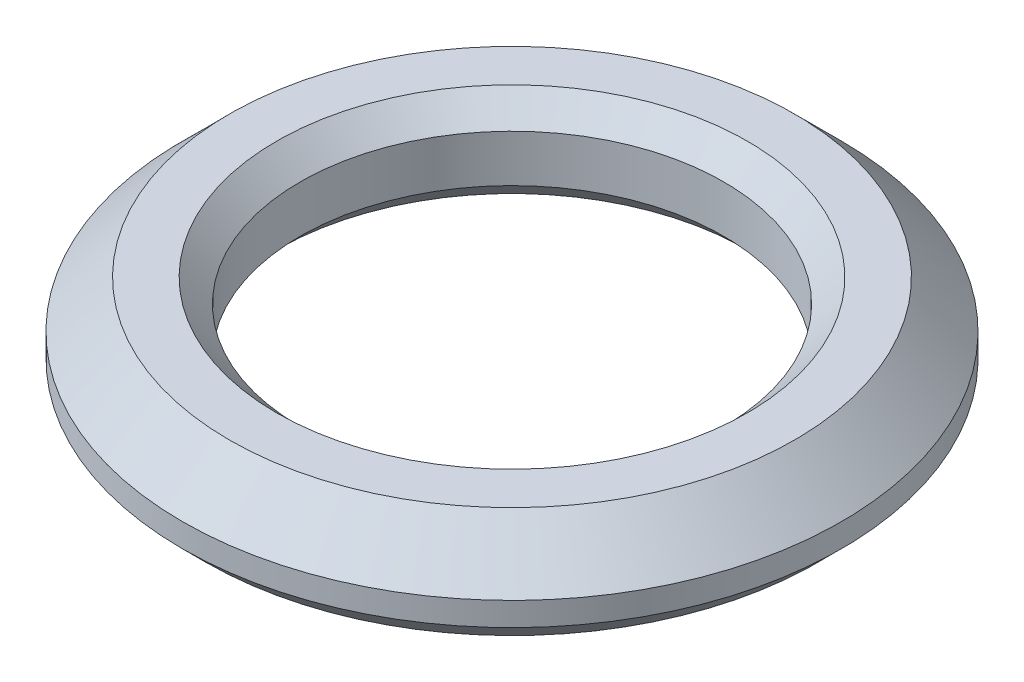
ISO-10303-21;
HEADER;
FILE_DESCRIPTION(('STEP AP214'),'2;1');
FILE_NAME('part.step','',(''),(''),'','','');
FILE_SCHEMA(('AUTOMOTIVE_DESIGN { 1 0 10303 214 1 1 1 1 }'));
ENDSEC;
DATA;
#1=APPLICATION_CONTEXT('core data for automotive mechanical design processes');
#2=APPLICATION_PROTOCOL_DEFINITION('international standard','automotive_design',2000,#1);
#3=PRODUCT_CONTEXT('',#1,'mechanical');
#4=PRODUCT('Part','Part','',(#3));
#5=PRODUCT_RELATED_PRODUCT_CATEGORY('part','',(#4));
#6=PRODUCT_DEFINITION_FORMATION('','',#4);
#7=PRODUCT_DEFINITION_CONTEXT('part definition',#1,'design');
#8=PRODUCT_DEFINITION('design','',#6,#7);
#9=PRODUCT_DEFINITION_SHAPE('','',#8);
#10=(LENGTH_UNIT() NAMED_UNIT(*) SI_UNIT(.MILLI.,.METRE.));
#11=(NAMED_UNIT(*) PLANE_ANGLE_UNIT() SI_UNIT($,.RADIAN.));
#12=(NAMED_UNIT(*) SI_UNIT($,.STERADIAN.) SOLID_ANGLE_UNIT());
#13=UNCERTAINTY_MEASURE_WITH_UNIT(LENGTH_MEASURE(1.E-05),#10,'distance_accuracy_value','');
#14=(GEOMETRIC_REPRESENTATION_CONTEXT(3) GLOBAL_UNCERTAINTY_ASSIGNED_CONTEXT((#13)) GLOBAL_UNIT_ASSIGNED_CONTEXT((#10,
#11,#12)) REPRESENTATION_CONTEXT('',''));
#15=CARTESIAN_POINT('',(0.,0.,0.));
#16=DIRECTION('',(0.,0.,1.));
#17=DIRECTION('',(1.,0.,0.));
#18=AXIS2_PLACEMENT_3D('',#15,#16,#17);
#19=CARTESIAN_POINT('',(0.,2.,0.));
#20=DIRECTION('',(0.,1.,0.));
#21=DIRECTION('',(0.,0.,1.));
#22=AXIS2_PLACEMENT_3D('',#19,#20,#21);
#23=PLANE('',#22);
#24=CARTESIAN_POINT('',(0.,2.,0.));
#25=DIRECTION('',(0.,1.,0.));
#26=DIRECTION('',(0.,0.,1.));
#27=AXIS2_PLACEMENT_3D('',#24,#25,#26);
#28=CIRCLE('',#27,5.);
#29=CARTESIAN_POINT('',(0.,2.,5.));
#30=VERTEX_POINT('',#29);
#31=EDGE_CURVE('E46',#30,#30,#28,.F.);
#32=ORIENTED_EDGE('',*,*,#31,.T.);
#33=EDGE_LOOP('',(#32));
#34=FACE_BOUND('',#33,.T.);
#35=CARTESIAN_POINT('',(0.,2.,0.));
#36=DIRECTION('',(0.,1.,0.));
#37=DIRECTION('',(0.,0.,1.));
#38=AXIS2_PLACEMENT_3D('',#35,#36,#37);
#39=CIRCLE('',#38,6.);
#40=CARTESIAN_POINT('',(0.,2.,6.));
#41=VERTEX_POINT('',#40);
#42=EDGE_CURVE('E60',#41,#41,#39,.T.);
#43=ORIENTED_EDGE('',*,*,#42,.T.);
#44=EDGE_LOOP('',(#43));
#45=FACE_BOUND('',#44,.T.);
#46=ADVANCED_FACE('F31',(#34,#45),#23,.T.);
#47=CARTESIAN_POINT('',(0.,0.,0.));
#48=DIRECTION('',(0.,1.,0.));
#49=DIRECTION('',(0.,0.,1.));
#50=AXIS2_PLACEMENT_3D('',#47,#48,#49);
#51=PLANE('',#50);
#52=CARTESIAN_POINT('',(0.,0.,0.));
#53=DIRECTION('',(0.,1.,0.));
#54=DIRECTION('',(0.,0.,1.));
#55=AXIS2_PLACEMENT_3D('',#52,#53,#54);
#56=CIRCLE('',#55,5.);
#57=CARTESIAN_POINT('',(0.,0.,5.));
#58=VERTEX_POINT('',#57);
#59=EDGE_CURVE('E38',#58,#58,#56,.T.);
#60=ORIENTED_EDGE('',*,*,#59,.T.);
#61=EDGE_LOOP('',(#60));
#62=FACE_BOUND('',#61,.T.);
#63=CARTESIAN_POINT('',(0.,0.,0.));
#64=DIRECTION('',(0.,1.,0.));
#65=DIRECTION('',(0.,0.,1.));
#66=AXIS2_PLACEMENT_3D('',#63,#64,#65);
#67=CIRCLE('',#66,6.5);
#68=CARTESIAN_POINT('',(0.,0.,6.5));
#69=VERTEX_POINT('',#68);
#70=EDGE_CURVE('E42',#69,#69,#67,.F.);
#71=ORIENTED_EDGE('',*,*,#70,.T.);
#72=EDGE_LOOP('',(#71));
#73=FACE_BOUND('',#72,.T.);
#74=ADVANCED_FACE('F84',(#62,#73),#51,.F.);
#75=CARTESIAN_POINT('',(0.,2.,0.));
#76=DIRECTION('',(0.,-1.,0.));
#77=DIRECTION('',(0.,0.,-1.));
#78=AXIS2_PLACEMENT_3D('',#75,#76,#77);
#79=CYLINDRICAL_SURFACE('',#78,7.);
#80=CARTESIAN_POINT('',(0.,0.5,0.));
#81=DIRECTION('',(0.,1.,0.));
#82=DIRECTION('',(0.,0.,1.));
#83=AXIS2_PLACEMENT_3D('',#80,#81,#82);
#84=CIRCLE('',#83,7.);
#85=CARTESIAN_POINT('',(0.,0.5,7.));
#86=VERTEX_POINT('',#85);
#87=EDGE_CURVE('E10',#86,#86,#84,.T.);
#88=ORIENTED_EDGE('',*,*,#87,.T.);
#89=EDGE_LOOP('',(#88));
#90=FACE_BOUND('',#89,.T.);
#91=CARTESIAN_POINT('',(0.,0.999999999999997,0.));
#92=DIRECTION('',(0.,1.,0.));
#93=DIRECTION('',(0.,0.,1.));
#94=AXIS2_PLACEMENT_3D('',#91,#92,#93);
#95=CIRCLE('',#94,7.);
#96=CARTESIAN_POINT('',(0.,0.999999999999997,7.));
#97=VERTEX_POINT('',#96);
#98=EDGE_CURVE('E57',#97,#97,#95,.F.);
#99=ORIENTED_EDGE('',*,*,#98,.T.);
#100=EDGE_LOOP('',(#99));
#101=FACE_BOUND('',#100,.T.);
#102=ADVANCED_FACE('F78',(#90,#101),#79,.T.);
#103=CARTESIAN_POINT('',(0.,2.,0.));
#104=DIRECTION('',(0.,-1.,0.));
#105=DIRECTION('',(0.,0.,-1.));
#106=AXIS2_PLACEMENT_3D('',#103,#104,#105);
#107=CYLINDRICAL_SURFACE('',#106,4.5);
#108=CARTESIAN_POINT('',(0.,1.5,0.));
#109=DIRECTION('',(0.,1.,0.));
#110=DIRECTION('',(0.,0.,1.));
#111=AXIS2_PLACEMENT_3D('',#108,#109,#110);
#112=CIRCLE('',#111,4.5);
#113=CARTESIAN_POINT('',(0.,1.5,4.5));
#114=VERTEX_POINT('',#113);
#115=EDGE_CURVE('E51',#114,#114,#112,.T.);
#116=ORIENTED_EDGE('',*,*,#115,.T.);
#117=EDGE_LOOP('',(#116));
#118=FACE_BOUND('',#117,.T.);
#119=CARTESIAN_POINT('',(0.,0.5,0.));
#120=DIRECTION('',(0.,1.,0.));
#121=DIRECTION('',(0.,0.,1.));
#122=AXIS2_PLACEMENT_3D('',#119,#120,#121);
#123=CIRCLE('',#122,4.5);
#124=CARTESIAN_POINT('',(0.,0.5,4.5));
#125=VERTEX_POINT('',#124);
#126=EDGE_CURVE('E54',#125,#125,#123,.F.);
#127=ORIENTED_EDGE('',*,*,#126,.T.);
#128=EDGE_LOOP('',(#127));
#129=FACE_BOUND('',#128,.T.);
#130=ADVANCED_FACE('F68',(#118,#129),#107,.F.);
#131=CARTESIAN_POINT('',(0.,2.,0.));
#132=DIRECTION('',(0.,-1.,0.));
#133=DIRECTION('',(0.,0.,-1.));
#134=AXIS2_PLACEMENT_3D('',#131,#132,#133);
#135=CONICAL_SURFACE('',#134,6.,0.785398163397447);
#136=ORIENTED_EDGE('',*,*,#98,.F.);
#137=EDGE_LOOP('',(#136));
#138=FACE_BOUND('',#137,.T.);
#139=ORIENTED_EDGE('',*,*,#42,.F.);
#140=EDGE_LOOP('',(#139));
#141=FACE_BOUND('',#140,.T.);
#142=ADVANCED_FACE('F65',(#138,#141),#135,.T.);
#143=CARTESIAN_POINT('',(0.,1.5,0.));
#144=DIRECTION('',(0.,1.,0.));
#145=DIRECTION('',(0.,0.,1.));
#146=AXIS2_PLACEMENT_3D('',#143,#144,#145);
#147=CONICAL_SURFACE('',#146,4.5,0.78539816339745);
#148=ORIENTED_EDGE('',*,*,#31,.F.);
#149=EDGE_LOOP('',(#148));
#150=FACE_BOUND('',#149,.T.);
#151=ORIENTED_EDGE('',*,*,#115,.F.);
#152=EDGE_LOOP('',(#151));
#153=FACE_BOUND('',#152,.T.);
#154=ADVANCED_FACE('F67',(#150,#153),#147,.F.);
#155=CARTESIAN_POINT('',(0.,0.,0.));
#156=DIRECTION('',(0.,-1.,0.));
#157=DIRECTION('',(0.,0.,-1.));
#158=AXIS2_PLACEMENT_3D('',#155,#156,#157);
#159=CONICAL_SURFACE('',#158,5.,0.785398163397447);
#160=ORIENTED_EDGE('',*,*,#126,.F.);
#161=EDGE_LOOP('',(#160));
#162=FACE_BOUND('',#161,.T.);
#163=ORIENTED_EDGE('',*,*,#59,.F.);
#164=EDGE_LOOP('',(#163));
#165=FACE_BOUND('',#164,.T.);
#166=ADVANCED_FACE('F75',(#162,#165),#159,.F.);
#167=CARTESIAN_POINT('',(0.,0.5,0.));
#168=DIRECTION('',(0.,1.,0.));
#169=DIRECTION('',(0.,0.,1.));
#170=AXIS2_PLACEMENT_3D('',#167,#168,#169);
#171=CONICAL_SURFACE('',#170,7.,0.78539816339745);
#172=ORIENTED_EDGE('',*,*,#70,.F.);
#173=EDGE_LOOP('',(#172));
#174=FACE_BOUND('',#173,.T.);
#175=ORIENTED_EDGE('',*,*,#87,.F.);
#176=EDGE_LOOP('',(#175));
#177=FACE_BOUND('',#176,.T.);
#178=ADVANCED_FACE('F33',(#174,#177),#171,.T.);
#179=CLOSED_SHELL('',(#46,#74,#102,#130,#142,#154,#166,#178));
#180=MANIFOLD_SOLID_BREP('B2',#179);
#181=ADVANCED_BREP_SHAPE_REPRESENTATION('',(#18,#180),#14);
#182=SHAPE_DEFINITION_REPRESENTATION(#9,#181);
ENDSEC;
END-ISO-10303-21;
